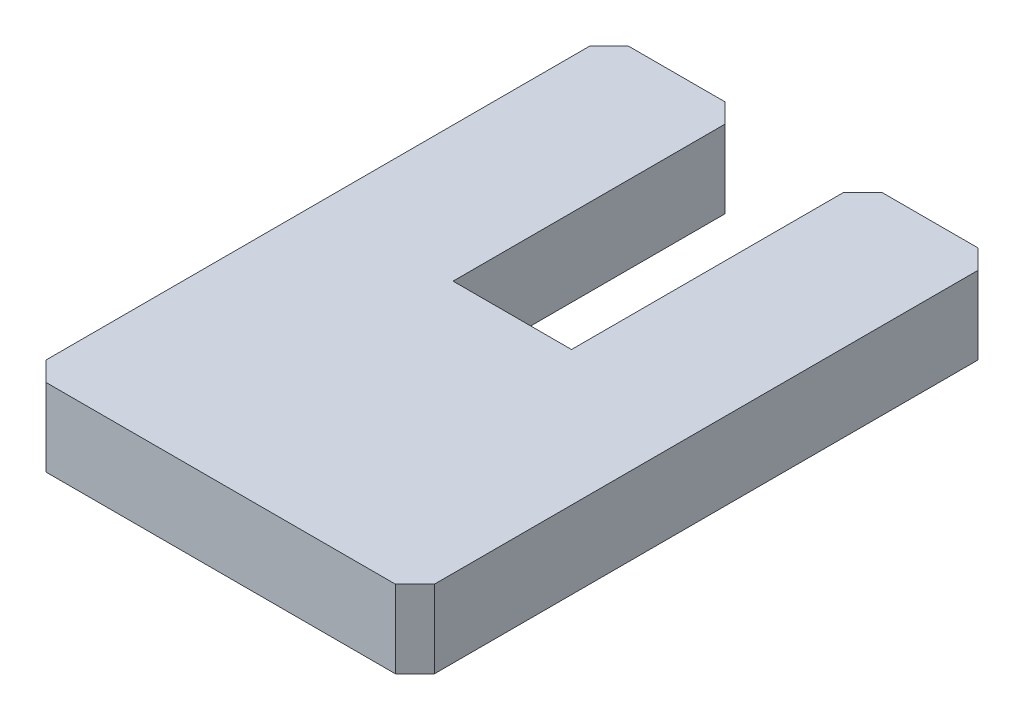
ISO-10303-21;
HEADER;
FILE_DESCRIPTION(('STEP AP214'),'2;1');
FILE_NAME('part.step','',(''),(''),'','','');
FILE_SCHEMA(('AUTOMOTIVE_DESIGN { 1 0 10303 214 1 1 1 1 }'));
ENDSEC;
DATA;
#1=APPLICATION_CONTEXT('core data for automotive mechanical design processes');
#2=APPLICATION_PROTOCOL_DEFINITION('international standard','automotive_design',2000,#1);
#3=PRODUCT_CONTEXT('',#1,'mechanical');
#4=PRODUCT('Part','Part','',(#3));
#5=PRODUCT_RELATED_PRODUCT_CATEGORY('part','',(#4));
#6=PRODUCT_DEFINITION_FORMATION('','',#4);
#7=PRODUCT_DEFINITION_CONTEXT('part definition',#1,'design');
#8=PRODUCT_DEFINITION('design','',#6,#7);
#9=PRODUCT_DEFINITION_SHAPE('','',#8);
#10=(LENGTH_UNIT() NAMED_UNIT(*) SI_UNIT(.MILLI.,.METRE.));
#11=(NAMED_UNIT(*) PLANE_ANGLE_UNIT() SI_UNIT($,.RADIAN.));
#12=(NAMED_UNIT(*) SI_UNIT($,.STERADIAN.) SOLID_ANGLE_UNIT());
#13=UNCERTAINTY_MEASURE_WITH_UNIT(LENGTH_MEASURE(1.E-05),#10,'distance_accuracy_value','');
#14=(GEOMETRIC_REPRESENTATION_CONTEXT(3) GLOBAL_UNCERTAINTY_ASSIGNED_CONTEXT((#13)) GLOBAL_UNIT_ASSIGNED_CONTEXT((#10,
#11,#12)) REPRESENTATION_CONTEXT('',''));
#15=CARTESIAN_POINT('',(0.,0.,0.));
#16=DIRECTION('',(0.,0.,1.));
#17=DIRECTION('',(1.,0.,0.));
#18=AXIS2_PLACEMENT_3D('',#15,#16,#17);
#19=CARTESIAN_POINT('',(-10.,4.,-15.));
#20=DIRECTION('',(0.,0.,1.));
#21=DIRECTION('',(1.,0.,0.));
#22=AXIS2_PLACEMENT_3D('',#19,#20,#21);
#23=PLANE('',#22);
#24=DIRECTION('',(-1.,0.,0.));
#25=VECTOR('',#24,1.);
#26=CARTESIAN_POINT('',(-10.,4.,-15.));
#27=LINE('',#26,#25);
#28=CARTESIAN_POINT('',(-4.03537209373418,4.,-15.));
#29=VERTEX_POINT('',#28);
#30=CARTESIAN_POINT('',(-8.99999999999999,4.,-15.));
#31=VERTEX_POINT('',#30);
#32=EDGE_CURVE('E175',#29,#31,#27,.T.);
#33=ORIENTED_EDGE('',*,*,#32,.F.);
#34=DIRECTION('',(0.,-1.,0.));
#35=VECTOR('',#34,1.);
#36=CARTESIAN_POINT('',(-4.03537209373418,4.,-15.));
#37=LINE('',#36,#35);
#38=CARTESIAN_POINT('',(-4.03537209373418,0.,-15.));
#39=VERTEX_POINT('',#38);
#40=EDGE_CURVE('E237',#29,#39,#37,.T.);
#41=ORIENTED_EDGE('',*,*,#40,.T.);
#42=DIRECTION('',(-1.,0.,0.));
#43=VECTOR('',#42,1.);
#44=CARTESIAN_POINT('',(-10.,0.,-15.));
#45=LINE('',#44,#43);
#46=CARTESIAN_POINT('',(-8.99999999999999,0.,-15.));
#47=VERTEX_POINT('',#46);
#48=EDGE_CURVE('E188',#39,#47,#45,.T.);
#49=ORIENTED_EDGE('',*,*,#48,.T.);
#50=DIRECTION('',(0.,1.,0.));
#51=VECTOR('',#50,1.);
#52=CARTESIAN_POINT('',(-8.99999999999999,4.,-15.));
#53=LINE('',#52,#51);
#54=EDGE_CURVE('E235',#47,#31,#53,.T.);
#55=ORIENTED_EDGE('',*,*,#54,.T.);
#56=EDGE_LOOP('',(#33,#41,#49,#55));
#57=FACE_BOUND('',#56,.T.);
#58=ADVANCED_FACE('F34',(#57),#23,.F.);
#59=CARTESIAN_POINT('',(10.,4.,15.));
#60=DIRECTION('',(-1.,0.,0.));
#61=DIRECTION('',(0.,0.,1.));
#62=AXIS2_PLACEMENT_3D('',#59,#60,#61);
#63=PLANE('',#62);
#64=DIRECTION('',(0.,0.,-1.));
#65=VECTOR('',#64,1.);
#66=CARTESIAN_POINT('',(10.,4.,15.));
#67=LINE('',#66,#65);
#68=CARTESIAN_POINT('',(10.,4.,14.));
#69=VERTEX_POINT('',#68);
#70=CARTESIAN_POINT('',(10.,4.,-14.));
#71=VERTEX_POINT('',#70);
#72=EDGE_CURVE('E172',#69,#71,#67,.T.);
#73=ORIENTED_EDGE('',*,*,#72,.F.);
#74=DIRECTION('',(0.,-1.,0.));
#75=VECTOR('',#74,1.);
#76=CARTESIAN_POINT('',(10.,4.,14.));
#77=LINE('',#76,#75);
#78=CARTESIAN_POINT('',(10.,0.,14.));
#79=VERTEX_POINT('',#78);
#80=EDGE_CURVE('E198',#69,#79,#77,.T.);
#81=ORIENTED_EDGE('',*,*,#80,.T.);
#82=DIRECTION('',(0.,0.,-1.));
#83=VECTOR('',#82,1.);
#84=CARTESIAN_POINT('',(10.,0.,15.));
#85=LINE('',#84,#83);
#86=CARTESIAN_POINT('',(10.,0.,-14.));
#87=VERTEX_POINT('',#86);
#88=EDGE_CURVE('E170',#79,#87,#85,.T.);
#89=ORIENTED_EDGE('',*,*,#88,.T.);
#90=DIRECTION('',(0.,1.,0.));
#91=VECTOR('',#90,1.);
#92=CARTESIAN_POINT('',(10.,4.,-14.));
#93=LINE('',#92,#91);
#94=EDGE_CURVE('E185',#87,#71,#93,.T.);
#95=ORIENTED_EDGE('',*,*,#94,.T.);
#96=EDGE_LOOP('',(#73,#81,#89,#95));
#97=FACE_BOUND('',#96,.T.);
#98=ADVANCED_FACE('F277',(#97),#63,.F.);
#99=CARTESIAN_POINT('',(8.99999999999999,0.,-15.));
#100=VERTEX_POINT('',#99);
#101=CARTESIAN_POINT('',(4.06462790626584,0.,-15.));
#102=VERTEX_POINT('',#101);
#103=EDGE_CURVE('E191',#100,#102,#45,.T.);
#104=ORIENTED_EDGE('',*,*,#103,.T.);
#105=DIRECTION('',(0.,1.,0.));
#106=VECTOR('',#105,1.);
#107=CARTESIAN_POINT('',(4.06462790626584,4.,-15.));
#108=LINE('',#107,#106);
#109=CARTESIAN_POINT('',(4.06462790626583,4.,-15.));
#110=VERTEX_POINT('',#109);
#111=EDGE_CURVE('E42',#102,#110,#108,.T.);
#112=ORIENTED_EDGE('',*,*,#111,.T.);
#113=CARTESIAN_POINT('',(8.99999999999999,4.,-15.));
#114=VERTEX_POINT('',#113);
#115=EDGE_CURVE('E177',#114,#110,#27,.T.);
#116=ORIENTED_EDGE('',*,*,#115,.F.);
#117=DIRECTION('',(0.,-1.,0.));
#118=VECTOR('',#117,1.);
#119=CARTESIAN_POINT('',(9.,4.,-15.));
#120=LINE('',#119,#118);
#121=EDGE_CURVE('E239',#114,#100,#120,.T.);
#122=ORIENTED_EDGE('',*,*,#121,.T.);
#123=EDGE_LOOP('',(#104,#112,#116,#122));
#124=FACE_BOUND('',#123,.T.);
#125=ADVANCED_FACE('F244',(#124),#23,.F.);
#126=CARTESIAN_POINT('',(-10.,4.,15.));
#127=DIRECTION('',(1.,0.,0.));
#128=DIRECTION('',(0.,0.,-1.));
#129=AXIS2_PLACEMENT_3D('',#126,#127,#128);
#130=PLANE('',#129);
#131=DIRECTION('',(0.,0.,1.));
#132=VECTOR('',#131,1.);
#133=CARTESIAN_POINT('',(-10.,0.,15.));
#134=LINE('',#133,#132);
#135=CARTESIAN_POINT('',(-10.,0.,-14.));
#136=VERTEX_POINT('',#135);
#137=CARTESIAN_POINT('',(-10.,0.,14.));
#138=VERTEX_POINT('',#137);
#139=EDGE_CURVE('E192',#136,#138,#134,.T.);
#140=ORIENTED_EDGE('',*,*,#139,.T.);
#141=DIRECTION('',(0.,1.,0.));
#142=VECTOR('',#141,1.);
#143=CARTESIAN_POINT('',(-10.,4.,14.));
#144=LINE('',#143,#142);
#145=CARTESIAN_POINT('',(-10.,4.,14.));
#146=VERTEX_POINT('',#145);
#147=EDGE_CURVE('E231',#138,#146,#144,.T.);
#148=ORIENTED_EDGE('',*,*,#147,.T.);
#149=DIRECTION('',(0.,0.,1.));
#150=VECTOR('',#149,1.);
#151=CARTESIAN_POINT('',(-10.,4.,15.));
#152=LINE('',#151,#150);
#153=CARTESIAN_POINT('',(-10.,4.,-14.));
#154=VERTEX_POINT('',#153);
#155=EDGE_CURVE('E179',#154,#146,#152,.T.);
#156=ORIENTED_EDGE('',*,*,#155,.F.);
#157=DIRECTION('',(0.,-1.,0.));
#158=VECTOR('',#157,1.);
#159=CARTESIAN_POINT('',(-10.,4.,-14.));
#160=LINE('',#159,#158);
#161=EDGE_CURVE('E228',#154,#136,#160,.T.);
#162=ORIENTED_EDGE('',*,*,#161,.T.);
#163=EDGE_LOOP('',(#140,#148,#156,#162));
#164=FACE_BOUND('',#163,.T.);
#165=ADVANCED_FACE('F286',(#164),#130,.F.);
#166=CARTESIAN_POINT('',(-10.,4.,15.));
#167=DIRECTION('',(0.,0.,-1.));
#168=DIRECTION('',(-1.,0.,0.));
#169=AXIS2_PLACEMENT_3D('',#166,#167,#168);
#170=PLANE('',#169);
#171=DIRECTION('',(1.,0.,0.));
#172=VECTOR('',#171,1.);
#173=CARTESIAN_POINT('',(-10.,0.,15.));
#174=LINE('',#173,#172);
#175=CARTESIAN_POINT('',(-8.99999999999999,0.,15.));
#176=VERTEX_POINT('',#175);
#177=CARTESIAN_POINT('',(8.99999999999999,0.,15.));
#178=VERTEX_POINT('',#177);
#179=EDGE_CURVE('E176',#176,#178,#174,.T.);
#180=ORIENTED_EDGE('',*,*,#179,.T.);
#181=DIRECTION('',(0.,1.,0.));
#182=VECTOR('',#181,1.);
#183=CARTESIAN_POINT('',(8.99999999999999,4.,15.));
#184=LINE('',#183,#182);
#185=CARTESIAN_POINT('',(8.99999999999999,4.,15.));
#186=VERTEX_POINT('',#185);
#187=EDGE_CURVE('E215',#178,#186,#184,.T.);
#188=ORIENTED_EDGE('',*,*,#187,.T.);
#189=DIRECTION('',(1.,0.,0.));
#190=VECTOR('',#189,1.);
#191=CARTESIAN_POINT('',(-10.,4.,15.));
#192=LINE('',#191,#190);
#193=CARTESIAN_POINT('',(-8.99999999999999,4.,15.));
#194=VERTEX_POINT('',#193);
#195=EDGE_CURVE('E182',#194,#186,#192,.T.);
#196=ORIENTED_EDGE('',*,*,#195,.F.);
#197=DIRECTION('',(0.,-1.,0.));
#198=VECTOR('',#197,1.);
#199=CARTESIAN_POINT('',(-8.99999999999999,4.,15.));
#200=LINE('',#199,#198);
#201=EDGE_CURVE('E212',#194,#176,#200,.T.);
#202=ORIENTED_EDGE('',*,*,#201,.T.);
#203=EDGE_LOOP('',(#180,#188,#196,#202));
#204=FACE_BOUND('',#203,.T.);
#205=ADVANCED_FACE('F290',(#204),#170,.F.);
#206=CARTESIAN_POINT('',(0.,4.,0.));
#207=DIRECTION('',(0.,-1.,0.));
#208=DIRECTION('',(0.,0.,-1.));
#209=AXIS2_PLACEMENT_3D('',#206,#207,#208);
#210=PLANE('',#209);
#211=ORIENTED_EDGE('',*,*,#195,.T.);
#212=DIRECTION('',(-0.707106781186549,0.,0.707106781186546));
#213=VECTOR('',#212,1.);
#214=CARTESIAN_POINT('',(10.,4.,14.));
#215=LINE('',#214,#213);
#216=EDGE_CURVE('E226',#186,#69,#215,.F.);
#217=ORIENTED_EDGE('',*,*,#216,.T.);
#218=ORIENTED_EDGE('',*,*,#72,.T.);
#219=DIRECTION('',(0.707106781186546,0.,0.707106781186549));
#220=VECTOR('',#219,1.);
#221=CARTESIAN_POINT('',(9.,4.,-15.));
#222=LINE('',#221,#220);
#223=EDGE_CURVE('E217',#71,#114,#222,.F.);
#224=ORIENTED_EDGE('',*,*,#223,.T.);
#225=ORIENTED_EDGE('',*,*,#115,.T.);
#226=DIRECTION('',(0.707106781186546,0.,-0.707106781186549));
#227=VECTOR('',#226,1.);
#228=CARTESIAN_POINT('',(4.06462790626584,4.,-15.));
#229=LINE('',#228,#227);
#230=CARTESIAN_POINT('',(3.06462790626583,4.,-14.));
#231=VERTEX_POINT('',#230);
#232=EDGE_CURVE('E49',#110,#231,#229,.F.);
#233=ORIENTED_EDGE('',*,*,#232,.T.);
#234=DIRECTION('',(0.,0.,-1.));
#235=VECTOR('',#234,1.);
#236=CARTESIAN_POINT('',(3.06462790626583,4.,0.));
#237=LINE('',#236,#235);
#238=CARTESIAN_POINT('',(3.06462790626583,4.,0.));
#239=VERTEX_POINT('',#238);
#240=EDGE_CURVE('E148',#239,#231,#237,.T.);
#241=ORIENTED_EDGE('',*,*,#240,.F.);
#242=DIRECTION('',(1.,0.,0.));
#243=VECTOR('',#242,1.);
#244=CARTESIAN_POINT('',(3.06462790626583,4.,0.));
#245=LINE('',#244,#243);
#246=CARTESIAN_POINT('',(-3.03537209373417,4.,0.));
#247=VERTEX_POINT('',#246);
#248=EDGE_CURVE('E167',#247,#239,#245,.T.);
#249=ORIENTED_EDGE('',*,*,#248,.F.);
#250=DIRECTION('',(0.,0.,1.));
#251=VECTOR('',#250,1.);
#252=CARTESIAN_POINT('',(-3.03537209373417,4.,0.));
#253=LINE('',#252,#251);
#254=CARTESIAN_POINT('',(-3.03537209373417,4.,-14.));
#255=VERTEX_POINT('',#254);
#256=EDGE_CURVE('E154',#255,#247,#253,.T.);
#257=ORIENTED_EDGE('',*,*,#256,.F.);
#258=DIRECTION('',(0.707106781186549,0.,0.707106781186546));
#259=VECTOR('',#258,1.);
#260=CARTESIAN_POINT('',(-3.03537209373417,4.,-14.));
#261=LINE('',#260,#259);
#262=EDGE_CURVE('E222',#255,#29,#261,.F.);
#263=ORIENTED_EDGE('',*,*,#262,.T.);
#264=ORIENTED_EDGE('',*,*,#32,.T.);
#265=DIRECTION('',(0.707106781186549,0.,-0.707106781186546));
#266=VECTOR('',#265,1.);
#267=CARTESIAN_POINT('',(-10.,4.,-14.));
#268=LINE('',#267,#266);
#269=EDGE_CURVE('E219',#31,#154,#268,.F.);
#270=ORIENTED_EDGE('',*,*,#269,.T.);
#271=ORIENTED_EDGE('',*,*,#155,.T.);
#272=DIRECTION('',(-0.707106781186548,0.,-0.707106781186548));
#273=VECTOR('',#272,1.);
#274=CARTESIAN_POINT('',(-8.99999999999999,4.,15.));
#275=LINE('',#274,#273);
#276=EDGE_CURVE('E224',#146,#194,#275,.F.);
#277=ORIENTED_EDGE('',*,*,#276,.T.);
#278=EDGE_LOOP('',(#211,#217,#218,#224,#225,#233,#241,#249,#257,#263,#264,#270,#271,#277));
#279=FACE_BOUND('',#278,.T.);
#280=ADVANCED_FACE('F248',(#279),#210,.F.);
#281=CARTESIAN_POINT('',(0.,0.,0.));
#282=DIRECTION('',(0.,-1.,0.));
#283=DIRECTION('',(0.,0.,-1.));
#284=AXIS2_PLACEMENT_3D('',#281,#282,#283);
#285=PLANE('',#284);
#286=ORIENTED_EDGE('',*,*,#88,.F.);
#287=DIRECTION('',(0.707106781186549,0.,-0.707106781186546));
#288=VECTOR('',#287,1.);
#289=CARTESIAN_POINT('',(12.,0.,12.));
#290=LINE('',#289,#288);
#291=EDGE_CURVE('E210',#79,#178,#290,.F.);
#292=ORIENTED_EDGE('',*,*,#291,.T.);
#293=ORIENTED_EDGE('',*,*,#179,.F.);
#294=DIRECTION('',(0.707106781186548,0.,0.707106781186548));
#295=VECTOR('',#294,1.);
#296=CARTESIAN_POINT('',(-12.,0.,12.));
#297=LINE('',#296,#295);
#298=EDGE_CURVE('E208',#176,#138,#297,.F.);
#299=ORIENTED_EDGE('',*,*,#298,.T.);
#300=ORIENTED_EDGE('',*,*,#139,.F.);
#301=DIRECTION('',(-0.707106781186549,0.,0.707106781186546));
#302=VECTOR('',#301,1.);
#303=CARTESIAN_POINT('',(-12.,0.,-12.));
#304=LINE('',#303,#302);
#305=EDGE_CURVE('E203',#136,#47,#304,.F.);
#306=ORIENTED_EDGE('',*,*,#305,.T.);
#307=ORIENTED_EDGE('',*,*,#48,.F.);
#308=DIRECTION('',(-0.707106781186549,0.,-0.707106781186546));
#309=VECTOR('',#308,1.);
#310=CARTESIAN_POINT('',(5.48231395313292,0.,-5.48231395313294));
#311=LINE('',#310,#309);
#312=CARTESIAN_POINT('',(-3.03537209373417,0.,-14.));
#313=VERTEX_POINT('',#312);
#314=EDGE_CURVE('E144',#39,#313,#311,.F.);
#315=ORIENTED_EDGE('',*,*,#314,.T.);
#316=DIRECTION('',(0.,0.,1.));
#317=VECTOR('',#316,1.);
#318=CARTESIAN_POINT('',(-3.03537209373417,0.,0.));
#319=LINE('',#318,#317);
#320=CARTESIAN_POINT('',(-3.03537209373417,0.,0.));
#321=VERTEX_POINT('',#320);
#322=EDGE_CURVE('E135',#313,#321,#319,.T.);
#323=ORIENTED_EDGE('',*,*,#322,.T.);
#324=DIRECTION('',(1.,0.,0.));
#325=VECTOR('',#324,1.);
#326=CARTESIAN_POINT('',(3.06462790626583,0.,0.));
#327=LINE('',#326,#325);
#328=CARTESIAN_POINT('',(3.06462790626583,0.,0.));
#329=VERTEX_POINT('',#328);
#330=EDGE_CURVE('E141',#321,#329,#327,.T.);
#331=ORIENTED_EDGE('',*,*,#330,.T.);
#332=DIRECTION('',(0.,0.,-1.));
#333=VECTOR('',#332,1.);
#334=CARTESIAN_POINT('',(3.06462790626583,0.,0.));
#335=LINE('',#334,#333);
#336=CARTESIAN_POINT('',(3.06462790626583,0.,-14.));
#337=VERTEX_POINT('',#336);
#338=EDGE_CURVE('E159',#329,#337,#335,.T.);
#339=ORIENTED_EDGE('',*,*,#338,.T.);
#340=DIRECTION('',(-0.707106781186546,0.,0.707106781186549));
#341=VECTOR('',#340,1.);
#342=CARTESIAN_POINT('',(-5.46768604686707,0.,-5.46768604686705));
#343=LINE('',#342,#341);
#344=EDGE_CURVE('E205',#337,#102,#343,.F.);
#345=ORIENTED_EDGE('',*,*,#344,.T.);
#346=ORIENTED_EDGE('',*,*,#103,.F.);
#347=DIRECTION('',(-0.707106781186546,0.,-0.707106781186549));
#348=VECTOR('',#347,1.);
#349=CARTESIAN_POINT('',(12.,0.,-12.));
#350=LINE('',#349,#348);
#351=EDGE_CURVE('E201',#100,#87,#350,.F.);
#352=ORIENTED_EDGE('',*,*,#351,.T.);
#353=EDGE_LOOP('',(#286,#292,#293,#299,#300,#306,#307,#315,#323,#331,#339,#345,#346,#352));
#354=FACE_BOUND('',#353,.T.);
#355=ADVANCED_FACE('F138',(#354),#285,.T.);
#356=CARTESIAN_POINT('',(-3.03537209373417,0.,0.));
#357=DIRECTION('',(-1.,0.,0.));
#358=DIRECTION('',(0.,0.,1.));
#359=AXIS2_PLACEMENT_3D('',#356,#357,#358);
#360=PLANE('',#359);
#361=ORIENTED_EDGE('',*,*,#322,.F.);
#362=DIRECTION('',(0.,1.,0.));
#363=VECTOR('',#362,1.);
#364=CARTESIAN_POINT('',(-3.03537209373417,0.,-14.));
#365=LINE('',#364,#363);
#366=EDGE_CURVE('E233',#313,#255,#365,.T.);
#367=ORIENTED_EDGE('',*,*,#366,.T.);
#368=ORIENTED_EDGE('',*,*,#256,.T.);
#369=DIRECTION('',(0.,1.,0.));
#370=VECTOR('',#369,1.);
#371=CARTESIAN_POINT('',(-3.03537209373417,0.,0.));
#372=LINE('',#371,#370);
#373=EDGE_CURVE('E151',#321,#247,#372,.T.);
#374=ORIENTED_EDGE('',*,*,#373,.F.);
#375=EDGE_LOOP('',(#361,#367,#368,#374));
#376=FACE_BOUND('',#375,.T.);
#377=ADVANCED_FACE('F152',(#376),#360,.F.);
#378=CARTESIAN_POINT('',(3.06462790626583,0.,0.));
#379=DIRECTION('',(1.,0.,0.));
#380=DIRECTION('',(0.,0.,-1.));
#381=AXIS2_PLACEMENT_3D('',#378,#379,#380);
#382=PLANE('',#381);
#383=ORIENTED_EDGE('',*,*,#240,.T.);
#384=DIRECTION('',(0.,-1.,0.));
#385=VECTOR('',#384,1.);
#386=CARTESIAN_POINT('',(3.06462790626583,0.,-14.));
#387=LINE('',#386,#385);
#388=EDGE_CURVE('E11',#231,#337,#387,.T.);
#389=ORIENTED_EDGE('',*,*,#388,.T.);
#390=ORIENTED_EDGE('',*,*,#338,.F.);
#391=DIRECTION('',(0.,1.,0.));
#392=VECTOR('',#391,1.);
#393=CARTESIAN_POINT('',(3.06462790626583,0.,0.));
#394=LINE('',#393,#392);
#395=EDGE_CURVE('E158',#329,#239,#394,.T.);
#396=ORIENTED_EDGE('',*,*,#395,.T.);
#397=EDGE_LOOP('',(#383,#389,#390,#396));
#398=FACE_BOUND('',#397,.T.);
#399=ADVANCED_FACE('F255',(#398),#382,.F.);
#400=CARTESIAN_POINT('',(3.06462790626583,0.,0.));
#401=DIRECTION('',(0.,0.,1.));
#402=DIRECTION('',(1.,0.,0.));
#403=AXIS2_PLACEMENT_3D('',#400,#401,#402);
#404=PLANE('',#403);
#405=ORIENTED_EDGE('',*,*,#248,.T.);
#406=ORIENTED_EDGE('',*,*,#395,.F.);
#407=ORIENTED_EDGE('',*,*,#330,.F.);
#408=ORIENTED_EDGE('',*,*,#373,.T.);
#409=EDGE_LOOP('',(#405,#406,#407,#408));
#410=FACE_BOUND('',#409,.T.);
#411=ADVANCED_FACE('F162',(#410),#404,.F.);
#412=CARTESIAN_POINT('',(10.,4.,14.));
#413=DIRECTION('',(-0.707106781186546,0.,-0.707106781186549));
#414=DIRECTION('',(0.,-1.,0.));
#415=AXIS2_PLACEMENT_3D('',#412,#413,#414);
#416=PLANE('',#415);
#417=ORIENTED_EDGE('',*,*,#216,.F.);
#418=ORIENTED_EDGE('',*,*,#187,.F.);
#419=ORIENTED_EDGE('',*,*,#291,.F.);
#420=ORIENTED_EDGE('',*,*,#80,.F.);
#421=EDGE_LOOP('',(#417,#418,#419,#420));
#422=FACE_BOUND('',#421,.T.);
#423=ADVANCED_FACE('F273',(#422),#416,.F.);
#424=CARTESIAN_POINT('',(-8.99999999999999,4.,15.));
#425=DIRECTION('',(0.707106781186547,0.,-0.707106781186547));
#426=DIRECTION('',(0.,-1.,0.));
#427=AXIS2_PLACEMENT_3D('',#424,#425,#426);
#428=PLANE('',#427);
#429=ORIENTED_EDGE('',*,*,#276,.F.);
#430=ORIENTED_EDGE('',*,*,#147,.F.);
#431=ORIENTED_EDGE('',*,*,#298,.F.);
#432=ORIENTED_EDGE('',*,*,#201,.F.);
#433=EDGE_LOOP('',(#429,#430,#431,#432));
#434=FACE_BOUND('',#433,.T.);
#435=ADVANCED_FACE('F265',(#434),#428,.F.);
#436=CARTESIAN_POINT('',(-3.03537209373417,0.,-14.));
#437=DIRECTION('',(-0.707106781186546,0.,0.707106781186549));
#438=DIRECTION('',(0.,1.,0.));
#439=AXIS2_PLACEMENT_3D('',#436,#437,#438);
#440=PLANE('',#439);
#441=ORIENTED_EDGE('',*,*,#314,.F.);
#442=ORIENTED_EDGE('',*,*,#40,.F.);
#443=ORIENTED_EDGE('',*,*,#262,.F.);
#444=ORIENTED_EDGE('',*,*,#366,.F.);
#445=EDGE_LOOP('',(#441,#442,#443,#444));
#446=FACE_BOUND('',#445,.T.);
#447=ADVANCED_FACE('F263',(#446),#440,.F.);
#448=CARTESIAN_POINT('',(4.06462790626584,4.,-15.));
#449=DIRECTION('',(0.707106781186549,0.,0.707106781186546));
#450=DIRECTION('',(0.,1.,0.));
#451=AXIS2_PLACEMENT_3D('',#448,#449,#450);
#452=PLANE('',#451);
#453=ORIENTED_EDGE('',*,*,#344,.F.);
#454=ORIENTED_EDGE('',*,*,#388,.F.);
#455=ORIENTED_EDGE('',*,*,#232,.F.);
#456=ORIENTED_EDGE('',*,*,#111,.F.);
#457=EDGE_LOOP('',(#453,#454,#455,#456));
#458=FACE_BOUND('',#457,.T.);
#459=ADVANCED_FACE('F253',(#458),#452,.F.);
#460=CARTESIAN_POINT('',(-10.,4.,-14.));
#461=DIRECTION('',(0.707106781186546,0.,0.707106781186549));
#462=DIRECTION('',(0.,-1.,0.));
#463=AXIS2_PLACEMENT_3D('',#460,#461,#462);
#464=PLANE('',#463);
#465=ORIENTED_EDGE('',*,*,#269,.F.);
#466=ORIENTED_EDGE('',*,*,#54,.F.);
#467=ORIENTED_EDGE('',*,*,#305,.F.);
#468=ORIENTED_EDGE('',*,*,#161,.F.);
#469=EDGE_LOOP('',(#465,#466,#467,#468));
#470=FACE_BOUND('',#469,.T.);
#471=ADVANCED_FACE('F271',(#470),#464,.F.);
#472=CARTESIAN_POINT('',(9.,4.,-15.));
#473=DIRECTION('',(-0.707106781186549,0.,0.707106781186546));
#474=DIRECTION('',(0.,-1.,0.));
#475=AXIS2_PLACEMENT_3D('',#472,#473,#474);
#476=PLANE('',#475);
#477=ORIENTED_EDGE('',*,*,#223,.F.);
#478=ORIENTED_EDGE('',*,*,#94,.F.);
#479=ORIENTED_EDGE('',*,*,#351,.F.);
#480=ORIENTED_EDGE('',*,*,#121,.F.);
#481=EDGE_LOOP('',(#477,#478,#479,#480));
#482=FACE_BOUND('',#481,.T.);
#483=ADVANCED_FACE('F36',(#482),#476,.F.);
#484=CLOSED_SHELL('',(#58,#98,#125,#165,#205,#280,#355,#377,#399,#411,#423,#435,#447,#459,#471,#483));
#485=MANIFOLD_SOLID_BREP('B2',#484);
#486=ADVANCED_BREP_SHAPE_REPRESENTATION('',(#18,#485),#14);
#487=SHAPE_DEFINITION_REPRESENTATION(#9,#486);
ENDSEC;
END-ISO-10303-21;
